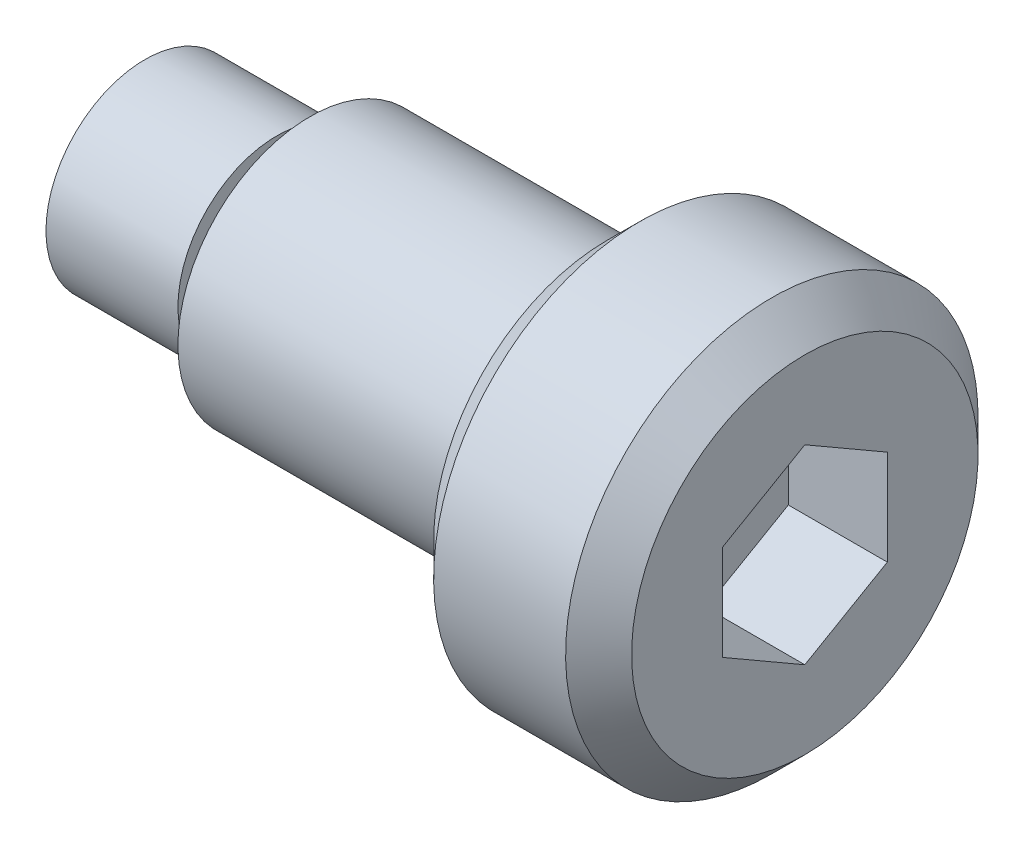
ISO-10303-21;
HEADER;
FILE_DESCRIPTION(('STEP AP214'),'2;1');
FILE_NAME('part.step','',(''),(''),'','','');
FILE_SCHEMA(('AUTOMOTIVE_DESIGN { 1 0 10303 214 1 1 1 1 }'));
ENDSEC;
DATA;
#1=APPLICATION_CONTEXT('core data for automotive mechanical design processes');
#2=APPLICATION_PROTOCOL_DEFINITION('international standard','automotive_design',2000,#1);
#3=PRODUCT_CONTEXT('',#1,'mechanical');
#4=PRODUCT('Part','Part','',(#3));
#5=PRODUCT_RELATED_PRODUCT_CATEGORY('part','',(#4));
#6=PRODUCT_DEFINITION_FORMATION('','',#4);
#7=PRODUCT_DEFINITION_CONTEXT('part definition',#1,'design');
#8=PRODUCT_DEFINITION('design','',#6,#7);
#9=PRODUCT_DEFINITION_SHAPE('','',#8);
#10=(LENGTH_UNIT() NAMED_UNIT(*) SI_UNIT(.MILLI.,.METRE.));
#11=(NAMED_UNIT(*) PLANE_ANGLE_UNIT() SI_UNIT($,.RADIAN.));
#12=(NAMED_UNIT(*) SI_UNIT($,.STERADIAN.) SOLID_ANGLE_UNIT());
#13=UNCERTAINTY_MEASURE_WITH_UNIT(LENGTH_MEASURE(1.E-05),#10,'distance_accuracy_value','');
#14=(GEOMETRIC_REPRESENTATION_CONTEXT(3) GLOBAL_UNCERTAINTY_ASSIGNED_CONTEXT((#13)) GLOBAL_UNIT_ASSIGNED_CONTEXT((#10,
#11,#12)) REPRESENTATION_CONTEXT('',''));
#15=CARTESIAN_POINT('',(0.,0.,0.));
#16=DIRECTION('',(0.,0.,1.));
#17=DIRECTION('',(1.,0.,0.));
#18=AXIS2_PLACEMENT_3D('',#15,#16,#17);
#19=CARTESIAN_POINT('',(20.,10.5,0.));
#20=DIRECTION('',(-1.,0.,0.));
#21=DIRECTION('',(0.,-1.,0.));
#22=AXIS2_PLACEMENT_3D('',#19,#20,#21);
#23=PLANE('',#22);
#24=CARTESIAN_POINT('',(20.,0.,0.));
#25=DIRECTION('',(-1.,0.,0.));
#26=DIRECTION('',(0.,-1.,0.));
#27=AXIS2_PLACEMENT_3D('',#24,#25,#26);
#28=CIRCLE('',#27,10.5);
#29=CARTESIAN_POINT('',(20.,-10.5,0.));
#30=VERTEX_POINT('',#29);
#31=EDGE_CURVE('E106',#30,#30,#28,.T.);
#32=ORIENTED_EDGE('',*,*,#31,.F.);
#33=EDGE_LOOP('',(#32));
#34=FACE_BOUND('',#33,.T.);
#35=DIRECTION('',(0.,0.5,0.866025403784439));
#36=VECTOR('',#35,1.);
#37=CARTESIAN_POINT('',(20.,6.9551270189222,2.0466333698683));
#38=LINE('',#37,#36);
#39=CARTESIAN_POINT('',(20.,2.88675134594813,-5.));
#40=VERTEX_POINT('',#39);
#41=CARTESIAN_POINT('',(20.,5.77350269189626,0.));
#42=VERTEX_POINT('',#41);
#43=EDGE_CURVE('E11',#40,#42,#38,.T.);
#44=ORIENTED_EDGE('',*,*,#43,.F.);
#45=DIRECTION('',(0.,1.,0.));
#46=VECTOR('',#45,1.);
#47=CARTESIAN_POINT('',(20.,10.5,-5.));
#48=LINE('',#47,#46);
#49=CARTESIAN_POINT('',(20.,-2.88675134594813,-5.));
#50=VERTEX_POINT('',#49);
#51=EDGE_CURVE('E188',#50,#40,#48,.T.);
#52=ORIENTED_EDGE('',*,*,#51,.F.);
#53=DIRECTION('',(0.,0.5,-0.866025403784439));
#54=VECTOR('',#53,1.);
#55=CARTESIAN_POINT('',(20.,-1.70512701892219,-7.0466333698683));
#56=LINE('',#55,#54);
#57=CARTESIAN_POINT('',(20.,-5.77350269189625,0.));
#58=VERTEX_POINT('',#57);
#59=EDGE_CURVE('E191',#58,#50,#56,.T.);
#60=ORIENTED_EDGE('',*,*,#59,.F.);
#61=DIRECTION('',(0.,-0.5,-0.866025403784439));
#62=VECTOR('',#61,1.);
#63=CARTESIAN_POINT('',(20.,-1.70512701892219,7.0466333698683));
#64=LINE('',#63,#62);
#65=CARTESIAN_POINT('',(20.,-2.88675134594813,5.));
#66=VERTEX_POINT('',#65);
#67=EDGE_CURVE('E194',#66,#58,#64,.T.);
#68=ORIENTED_EDGE('',*,*,#67,.F.);
#69=DIRECTION('',(0.,-1.,0.));
#70=VECTOR('',#69,1.);
#71=CARTESIAN_POINT('',(20.,10.5,5.));
#72=LINE('',#71,#70);
#73=CARTESIAN_POINT('',(20.,2.88675134594813,5.));
#74=VERTEX_POINT('',#73);
#75=EDGE_CURVE('E197',#74,#66,#72,.T.);
#76=ORIENTED_EDGE('',*,*,#75,.F.);
#77=DIRECTION('',(0.,-0.5,0.866025403784439));
#78=VECTOR('',#77,1.);
#79=CARTESIAN_POINT('',(20.,6.9551270189222,-2.0466333698683));
#80=LINE('',#79,#78);
#81=EDGE_CURVE('E55',#42,#74,#80,.T.);
#82=ORIENTED_EDGE('',*,*,#81,.F.);
#83=EDGE_LOOP('',(#44,#52,#60,#68,#76,#82));
#84=FACE_BOUND('',#83,.T.);
#85=ADVANCED_FACE('F46',(#34,#84),#23,.F.);
#86=CARTESIAN_POINT('',(-20.,0.,0.));
#87=DIRECTION('',(1.,0.,0.));
#88=DIRECTION('',(0.,1.,0.));
#89=AXIS2_PLACEMENT_3D('',#86,#87,#88);
#90=PLANE('',#89);
#91=CARTESIAN_POINT('',(-20.,0.,0.));
#92=DIRECTION('',(-1.,0.,0.));
#93=DIRECTION('',(0.,-1.,0.));
#94=AXIS2_PLACEMENT_3D('',#91,#92,#93);
#95=CIRCLE('',#94,6.);
#96=CARTESIAN_POINT('',(-20.,-6.,0.));
#97=VERTEX_POINT('',#96);
#98=EDGE_CURVE('E184',#97,#97,#95,.T.);
#99=ORIENTED_EDGE('',*,*,#98,.T.);
#100=EDGE_LOOP('',(#99));
#101=FACE_BOUND('',#100,.T.);
#102=ADVANCED_FACE('F48',(#101),#90,.F.);
#103=CARTESIAN_POINT('',(-20.,0.,0.));
#104=DIRECTION('',(-1.,0.,0.));
#105=DIRECTION('',(0.,-1.,0.));
#106=AXIS2_PLACEMENT_3D('',#103,#104,#105);
#107=CYLINDRICAL_SURFACE('',#106,6.);
#108=ORIENTED_EDGE('',*,*,#98,.F.);
#109=EDGE_LOOP('',(#108));
#110=FACE_BOUND('',#109,.T.);
#111=CARTESIAN_POINT('',(-12.,0.,0.));
#112=DIRECTION('',(-1.,0.,0.));
#113=DIRECTION('',(0.,-1.,0.));
#114=AXIS2_PLACEMENT_3D('',#111,#112,#113);
#115=CIRCLE('',#114,6.);
#116=CARTESIAN_POINT('',(-12.,-6.,0.));
#117=VERTEX_POINT('',#116);
#118=EDGE_CURVE('E180',#117,#117,#115,.T.);
#119=ORIENTED_EDGE('',*,*,#118,.T.);
#120=EDGE_LOOP('',(#119));
#121=FACE_BOUND('',#120,.T.);
#122=ADVANCED_FACE('F230',(#110,#121),#107,.T.);
#123=CARTESIAN_POINT('',(-12.,6.,0.));
#124=DIRECTION('',(-1.,0.,0.));
#125=DIRECTION('',(0.,-1.,0.));
#126=AXIS2_PLACEMENT_3D('',#123,#124,#125);
#127=PLANE('',#126);
#128=ORIENTED_EDGE('',*,*,#118,.F.);
#129=EDGE_LOOP('',(#128));
#130=FACE_BOUND('',#129,.T.);
#131=CARTESIAN_POINT('',(-12.,0.,0.));
#132=DIRECTION('',(-1.,0.,0.));
#133=DIRECTION('',(0.,-1.,0.));
#134=AXIS2_PLACEMENT_3D('',#131,#132,#133);
#135=CIRCLE('',#134,5.);
#136=CARTESIAN_POINT('',(-12.,-5.,0.));
#137=VERTEX_POINT('',#136);
#138=EDGE_CURVE('E176',#137,#137,#135,.T.);
#139=ORIENTED_EDGE('',*,*,#138,.T.);
#140=EDGE_LOOP('',(#139));
#141=FACE_BOUND('',#140,.T.);
#142=ADVANCED_FACE('F263',(#130,#141),#127,.F.);
#143=CARTESIAN_POINT('',(-20.,0.,0.));
#144=DIRECTION('',(-1.,0.,0.));
#145=DIRECTION('',(0.,-1.,0.));
#146=AXIS2_PLACEMENT_3D('',#143,#144,#145);
#147=CYLINDRICAL_SURFACE('',#146,5.);
#148=ORIENTED_EDGE('',*,*,#138,.F.);
#149=EDGE_LOOP('',(#148));
#150=FACE_BOUND('',#149,.T.);
#151=CARTESIAN_POINT('',(-10.,0.,0.));
#152=DIRECTION('',(-1.,0.,0.));
#153=DIRECTION('',(0.,-1.,0.));
#154=AXIS2_PLACEMENT_3D('',#151,#152,#153);
#155=CIRCLE('',#154,5.);
#156=CARTESIAN_POINT('',(-10.,-5.,0.));
#157=VERTEX_POINT('',#156);
#158=EDGE_CURVE('E172',#157,#157,#155,.T.);
#159=ORIENTED_EDGE('',*,*,#158,.T.);
#160=EDGE_LOOP('',(#159));
#161=FACE_BOUND('',#160,.T.);
#162=ADVANCED_FACE('F259',(#150,#161),#147,.T.);
#163=CARTESIAN_POINT('',(-10.,5.,0.));
#164=DIRECTION('',(1.,0.,0.));
#165=DIRECTION('',(0.,1.,0.));
#166=AXIS2_PLACEMENT_3D('',#163,#164,#165);
#167=PLANE('',#166);
#168=ORIENTED_EDGE('',*,*,#158,.F.);
#169=EDGE_LOOP('',(#168));
#170=FACE_BOUND('',#169,.T.);
#171=CARTESIAN_POINT('',(-10.,0.,0.));
#172=DIRECTION('',(-1.,0.,0.));
#173=DIRECTION('',(0.,-1.,0.));
#174=AXIS2_PLACEMENT_3D('',#171,#172,#173);
#175=CIRCLE('',#174,8.);
#176=CARTESIAN_POINT('',(-10.,-8.,0.));
#177=VERTEX_POINT('',#176);
#178=EDGE_CURVE('E168',#177,#177,#175,.T.);
#179=ORIENTED_EDGE('',*,*,#178,.T.);
#180=EDGE_LOOP('',(#179));
#181=FACE_BOUND('',#180,.T.);
#182=ADVANCED_FACE('F255',(#170,#181),#167,.F.);
#183=CARTESIAN_POINT('',(-20.,0.,0.));
#184=DIRECTION('',(-1.,0.,0.));
#185=DIRECTION('',(0.,-1.,0.));
#186=AXIS2_PLACEMENT_3D('',#183,#184,#185);
#187=CYLINDRICAL_SURFACE('',#186,8.);
#188=ORIENTED_EDGE('',*,*,#178,.F.);
#189=EDGE_LOOP('',(#188));
#190=FACE_BOUND('',#189,.T.);
#191=CARTESIAN_POINT('',(8.,0.,0.));
#192=DIRECTION('',(-1.,0.,0.));
#193=DIRECTION('',(0.,-1.,0.));
#194=AXIS2_PLACEMENT_3D('',#191,#192,#193);
#195=CIRCLE('',#194,7.99999999999999);
#196=CARTESIAN_POINT('',(8.00000000000001,-7.99999999999999,0.));
#197=VERTEX_POINT('',#196);
#198=EDGE_CURVE('E164',#197,#197,#195,.T.);
#199=ORIENTED_EDGE('',*,*,#198,.T.);
#200=EDGE_LOOP('',(#199));
#201=FACE_BOUND('',#200,.T.);
#202=ADVANCED_FACE('F251',(#190,#201),#187,.T.);
#203=CARTESIAN_POINT('',(8.,8.,0.));
#204=DIRECTION('',(1.,0.,0.));
#205=DIRECTION('',(0.,1.,0.));
#206=AXIS2_PLACEMENT_3D('',#203,#204,#205);
#207=PLANE('',#206);
#208=ORIENTED_EDGE('',*,*,#198,.F.);
#209=EDGE_LOOP('',(#208));
#210=FACE_BOUND('',#209,.T.);
#211=CARTESIAN_POINT('',(8.00000000000001,0.,0.));
#212=DIRECTION('',(-1.,0.,0.));
#213=DIRECTION('',(0.,-1.,0.));
#214=AXIS2_PLACEMENT_3D('',#211,#212,#213);
#215=CIRCLE('',#214,10.5);
#216=CARTESIAN_POINT('',(8.00000000000001,-10.5,0.));
#217=VERTEX_POINT('',#216);
#218=EDGE_CURVE('E160',#217,#217,#215,.T.);
#219=ORIENTED_EDGE('',*,*,#218,.T.);
#220=EDGE_LOOP('',(#219));
#221=FACE_BOUND('',#220,.T.);
#222=ADVANCED_FACE('F247',(#210,#221),#207,.F.);
#223=CARTESIAN_POINT('',(10.,0.,0.));
#224=DIRECTION('',(1.,0.,0.));
#225=DIRECTION('',(0.,1.,0.));
#226=AXIS2_PLACEMENT_3D('',#223,#224,#225);
#227=CONICAL_SURFACE('',#226,12.5,0.78539816339745);
#228=ORIENTED_EDGE('',*,*,#218,.F.);
#229=EDGE_LOOP('',(#228));
#230=FACE_BOUND('',#229,.T.);
#231=CARTESIAN_POINT('',(10.,0.,0.));
#232=DIRECTION('',(-1.,0.,0.));
#233=DIRECTION('',(0.,-1.,0.));
#234=AXIS2_PLACEMENT_3D('',#231,#232,#233);
#235=CIRCLE('',#234,12.5);
#236=CARTESIAN_POINT('',(10.,-12.5,0.));
#237=VERTEX_POINT('',#236);
#238=EDGE_CURVE('E156',#237,#237,#235,.T.);
#239=ORIENTED_EDGE('',*,*,#238,.T.);
#240=EDGE_LOOP('',(#239));
#241=FACE_BOUND('',#240,.T.);
#242=ADVANCED_FACE('F243',(#230,#241),#227,.T.);
#243=CARTESIAN_POINT('',(-20.,0.,0.));
#244=DIRECTION('',(-1.,0.,0.));
#245=DIRECTION('',(0.,-1.,0.));
#246=AXIS2_PLACEMENT_3D('',#243,#244,#245);
#247=CYLINDRICAL_SURFACE('',#246,12.5);
#248=ORIENTED_EDGE('',*,*,#238,.F.);
#249=EDGE_LOOP('',(#248));
#250=FACE_BOUND('',#249,.T.);
#251=CARTESIAN_POINT('',(18.,0.,0.));
#252=DIRECTION('',(-1.,0.,0.));
#253=DIRECTION('',(0.,-1.,0.));
#254=AXIS2_PLACEMENT_3D('',#251,#252,#253);
#255=CIRCLE('',#254,12.5);
#256=CARTESIAN_POINT('',(18.,-12.5,0.));
#257=VERTEX_POINT('',#256);
#258=EDGE_CURVE('E152',#257,#257,#255,.T.);
#259=ORIENTED_EDGE('',*,*,#258,.T.);
#260=EDGE_LOOP('',(#259));
#261=FACE_BOUND('',#260,.T.);
#262=ADVANCED_FACE('F239',(#250,#261),#247,.T.);
#263=CARTESIAN_POINT('',(20.,0.,0.));
#264=DIRECTION('',(-1.,0.,0.));
#265=DIRECTION('',(0.,-1.,0.));
#266=AXIS2_PLACEMENT_3D('',#263,#264,#265);
#267=CONICAL_SURFACE('',#266,10.5,0.785398163397447);
#268=ORIENTED_EDGE('',*,*,#258,.F.);
#269=EDGE_LOOP('',(#268));
#270=FACE_BOUND('',#269,.T.);
#271=ORIENTED_EDGE('',*,*,#31,.T.);
#272=EDGE_LOOP('',(#271));
#273=FACE_BOUND('',#272,.T.);
#274=ADVANCED_FACE('F236',(#270,#273),#267,.T.);
#275=CARTESIAN_POINT('',(20.000012,2.88675134594813,-5.));
#276=DIRECTION('',(0.,-0.866025403784439,0.5));
#277=DIRECTION('',(0.,-0.5,-0.866025403784439));
#278=AXIS2_PLACEMENT_3D('',#275,#276,#277);
#279=PLANE('',#278);
#280=ORIENTED_EDGE('',*,*,#43,.T.);
#281=DIRECTION('',(-1.,0.,0.));
#282=VECTOR('',#281,1.);
#283=CARTESIAN_POINT('',(20.000012,5.77350269189626,0.));
#284=LINE('',#283,#282);
#285=CARTESIAN_POINT('',(14.,5.77350269189626,0.));
#286=VERTEX_POINT('',#285);
#287=EDGE_CURVE('E97',#42,#286,#284,.T.);
#288=ORIENTED_EDGE('',*,*,#287,.T.);
#289=DIRECTION('',(0.,0.5,0.866025403784439));
#290=VECTOR('',#289,1.);
#291=CARTESIAN_POINT('',(14.,2.88675134594813,-5.));
#292=LINE('',#291,#290);
#293=CARTESIAN_POINT('',(14.,2.88675134594813,-5.));
#294=VERTEX_POINT('',#293);
#295=EDGE_CURVE('E101',#294,#286,#292,.T.);
#296=ORIENTED_EDGE('',*,*,#295,.F.);
#297=DIRECTION('',(-1.,0.,0.));
#298=VECTOR('',#297,1.);
#299=CARTESIAN_POINT('',(20.000012,2.88675134594813,-5.));
#300=LINE('',#299,#298);
#301=EDGE_CURVE('E136',#40,#294,#300,.T.);
#302=ORIENTED_EDGE('',*,*,#301,.F.);
#303=EDGE_LOOP('',(#280,#288,#296,#302));
#304=FACE_BOUND('',#303,.T.);
#305=ADVANCED_FACE('F99',(#304),#279,.T.);
#306=CARTESIAN_POINT('',(20.000012,5.77350269189626,0.));
#307=DIRECTION('',(0.,-0.866025403784439,-0.5));
#308=DIRECTION('',(0.,0.5,-0.866025403784439));
#309=AXIS2_PLACEMENT_3D('',#306,#307,#308);
#310=PLANE('',#309);
#311=ORIENTED_EDGE('',*,*,#81,.T.);
#312=DIRECTION('',(-1.,0.,0.));
#313=VECTOR('',#312,1.);
#314=CARTESIAN_POINT('',(20.000012,2.88675134594813,5.));
#315=LINE('',#314,#313);
#316=CARTESIAN_POINT('',(14.,2.88675134594813,5.));
#317=VERTEX_POINT('',#316);
#318=EDGE_CURVE('E107',#74,#317,#315,.T.);
#319=ORIENTED_EDGE('',*,*,#318,.T.);
#320=DIRECTION('',(0.,-0.5,0.866025403784439));
#321=VECTOR('',#320,1.);
#322=CARTESIAN_POINT('',(14.,5.77350269189626,0.));
#323=LINE('',#322,#321);
#324=EDGE_CURVE('E110',#286,#317,#323,.T.);
#325=ORIENTED_EDGE('',*,*,#324,.F.);
#326=ORIENTED_EDGE('',*,*,#287,.F.);
#327=EDGE_LOOP('',(#311,#319,#325,#326));
#328=FACE_BOUND('',#327,.T.);
#329=ADVANCED_FACE('F111',(#328),#310,.T.);
#330=CARTESIAN_POINT('',(20.000012,2.88675134594813,5.));
#331=DIRECTION('',(0.,0.,-1.));
#332=DIRECTION('',(-1.,0.,0.));
#333=AXIS2_PLACEMENT_3D('',#330,#331,#332);
#334=PLANE('',#333);
#335=ORIENTED_EDGE('',*,*,#75,.T.);
#336=DIRECTION('',(-1.,0.,0.));
#337=VECTOR('',#336,1.);
#338=CARTESIAN_POINT('',(20.000012,-2.88675134594813,5.));
#339=LINE('',#338,#337);
#340=CARTESIAN_POINT('',(14.,-2.88675134594813,5.));
#341=VERTEX_POINT('',#340);
#342=EDGE_CURVE('E144',#66,#341,#339,.T.);
#343=ORIENTED_EDGE('',*,*,#342,.T.);
#344=DIRECTION('',(0.,-1.,0.));
#345=VECTOR('',#344,1.);
#346=CARTESIAN_POINT('',(14.,2.88675134594813,5.));
#347=LINE('',#346,#345);
#348=EDGE_CURVE('E117',#317,#341,#347,.T.);
#349=ORIENTED_EDGE('',*,*,#348,.F.);
#350=ORIENTED_EDGE('',*,*,#318,.F.);
#351=EDGE_LOOP('',(#335,#343,#349,#350));
#352=FACE_BOUND('',#351,.T.);
#353=ADVANCED_FACE('F203',(#352),#334,.T.);
#354=CARTESIAN_POINT('',(20.000012,-2.88675134594813,5.));
#355=DIRECTION('',(0.,0.866025403784439,-0.5));
#356=DIRECTION('',(0.,0.5,0.866025403784439));
#357=AXIS2_PLACEMENT_3D('',#354,#355,#356);
#358=PLANE('',#357);
#359=ORIENTED_EDGE('',*,*,#67,.T.);
#360=DIRECTION('',(-1.,0.,0.));
#361=VECTOR('',#360,1.);
#362=CARTESIAN_POINT('',(20.000012,-5.77350269189625,0.));
#363=LINE('',#362,#361);
#364=CARTESIAN_POINT('',(14.,-5.77350269189626,0.));
#365=VERTEX_POINT('',#364);
#366=EDGE_CURVE('E141',#58,#365,#363,.T.);
#367=ORIENTED_EDGE('',*,*,#366,.T.);
#368=DIRECTION('',(0.,-0.5,-0.866025403784439));
#369=VECTOR('',#368,1.);
#370=CARTESIAN_POINT('',(14.,-2.88675134594813,5.));
#371=LINE('',#370,#369);
#372=EDGE_CURVE('E127',#341,#365,#371,.T.);
#373=ORIENTED_EDGE('',*,*,#372,.F.);
#374=ORIENTED_EDGE('',*,*,#342,.F.);
#375=EDGE_LOOP('',(#359,#367,#373,#374));
#376=FACE_BOUND('',#375,.T.);
#377=ADVANCED_FACE('F210',(#376),#358,.T.);
#378=CARTESIAN_POINT('',(20.000012,-5.77350269189625,0.));
#379=DIRECTION('',(0.,0.866025403784439,0.5));
#380=DIRECTION('',(0.,-0.5,0.866025403784439));
#381=AXIS2_PLACEMENT_3D('',#378,#379,#380);
#382=PLANE('',#381);
#383=ORIENTED_EDGE('',*,*,#59,.T.);
#384=DIRECTION('',(-1.,0.,0.));
#385=VECTOR('',#384,1.);
#386=CARTESIAN_POINT('',(20.000012,-2.88675134594813,-5.));
#387=LINE('',#386,#385);
#388=CARTESIAN_POINT('',(14.,-2.88675134594813,-5.));
#389=VERTEX_POINT('',#388);
#390=EDGE_CURVE('E62',#50,#389,#387,.T.);
#391=ORIENTED_EDGE('',*,*,#390,.T.);
#392=DIRECTION('',(0.,0.5,-0.866025403784439));
#393=VECTOR('',#392,1.);
#394=CARTESIAN_POINT('',(14.,-5.77350269189626,0.));
#395=LINE('',#394,#393);
#396=EDGE_CURVE('E131',#365,#389,#395,.T.);
#397=ORIENTED_EDGE('',*,*,#396,.F.);
#398=ORIENTED_EDGE('',*,*,#366,.F.);
#399=EDGE_LOOP('',(#383,#391,#397,#398));
#400=FACE_BOUND('',#399,.T.);
#401=ADVANCED_FACE('F214',(#400),#382,.T.);
#402=CARTESIAN_POINT('',(20.000012,-2.88675134594813,-5.));
#403=DIRECTION('',(0.,0.,1.));
#404=DIRECTION('',(1.,0.,0.));
#405=AXIS2_PLACEMENT_3D('',#402,#403,#404);
#406=PLANE('',#405);
#407=ORIENTED_EDGE('',*,*,#51,.T.);
#408=ORIENTED_EDGE('',*,*,#301,.T.);
#409=DIRECTION('',(0.,1.,0.));
#410=VECTOR('',#409,1.);
#411=CARTESIAN_POINT('',(14.,-2.88675134594813,-5.));
#412=LINE('',#411,#410);
#413=EDGE_CURVE('E121',#389,#294,#412,.T.);
#414=ORIENTED_EDGE('',*,*,#413,.F.);
#415=ORIENTED_EDGE('',*,*,#390,.F.);
#416=EDGE_LOOP('',(#407,#408,#414,#415));
#417=FACE_BOUND('',#416,.T.);
#418=ADVANCED_FACE('F215',(#417),#406,.T.);
#419=CARTESIAN_POINT('',(14.,0.,0.));
#420=DIRECTION('',(1.,0.,0.));
#421=DIRECTION('',(0.,0.,-1.));
#422=AXIS2_PLACEMENT_3D('',#419,#420,#421);
#423=PLANE('',#422);
#424=ORIENTED_EDGE('',*,*,#295,.T.);
#425=ORIENTED_EDGE('',*,*,#324,.T.);
#426=ORIENTED_EDGE('',*,*,#348,.T.);
#427=ORIENTED_EDGE('',*,*,#372,.T.);
#428=ORIENTED_EDGE('',*,*,#396,.T.);
#429=ORIENTED_EDGE('',*,*,#413,.T.);
#430=EDGE_LOOP('',(#424,#425,#426,#427,#428,#429));
#431=FACE_BOUND('',#430,.T.);
#432=ADVANCED_FACE('F119',(#431),#423,.T.);
#433=CLOSED_SHELL('',(#85,#102,#122,#142,#162,#182,#202,#222,#242,#262,#274,#305,#329,#353,#377,
#401,#418,#432));
#434=MANIFOLD_SOLID_BREP('B2',#433);
#435=ADVANCED_BREP_SHAPE_REPRESENTATION('',(#18,#434),#14);
#436=SHAPE_DEFINITION_REPRESENTATION(#9,#435);
ENDSEC;
END-ISO-10303-21;
